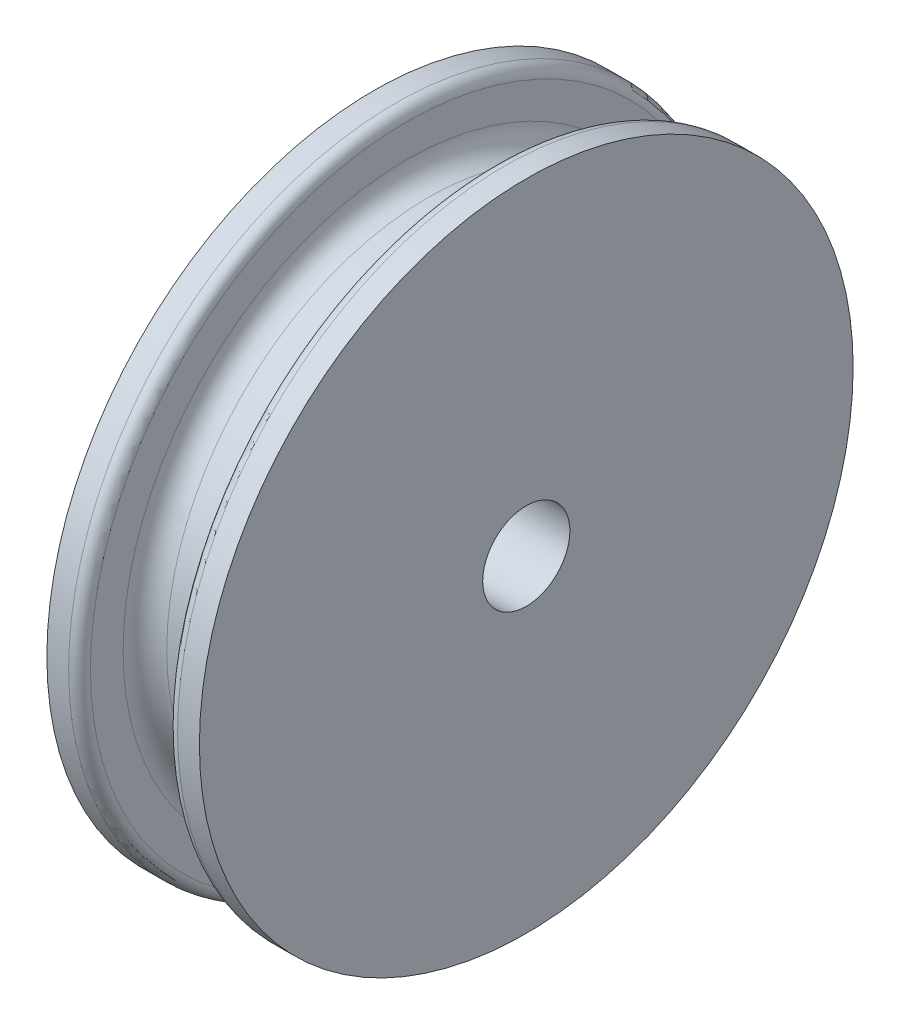
ISO-10303-21;
HEADER;
FILE_DESCRIPTION(('STEP AP214'),'2;1');
FILE_NAME('part.step','',(''),(''),'','','');
FILE_SCHEMA(('AUTOMOTIVE_DESIGN { 1 0 10303 214 1 1 1 1 }'));
ENDSEC;
DATA;
#1=APPLICATION_CONTEXT('core data for automotive mechanical design processes');
#2=APPLICATION_PROTOCOL_DEFINITION('international standard','automotive_design',2000,#1);
#3=PRODUCT_CONTEXT('',#1,'mechanical');
#4=PRODUCT('Part','Part','',(#3));
#5=PRODUCT_RELATED_PRODUCT_CATEGORY('part','',(#4));
#6=PRODUCT_DEFINITION_FORMATION('','',#4);
#7=PRODUCT_DEFINITION_CONTEXT('part definition',#1,'design');
#8=PRODUCT_DEFINITION('design','',#6,#7);
#9=PRODUCT_DEFINITION_SHAPE('','',#8);
#10=(LENGTH_UNIT() NAMED_UNIT(*) SI_UNIT(.MILLI.,.METRE.));
#11=(NAMED_UNIT(*) PLANE_ANGLE_UNIT() SI_UNIT($,.RADIAN.));
#12=(NAMED_UNIT(*) SI_UNIT($,.STERADIAN.) SOLID_ANGLE_UNIT());
#13=UNCERTAINTY_MEASURE_WITH_UNIT(LENGTH_MEASURE(1.E-05),#10,'distance_accuracy_value','');
#14=(GEOMETRIC_REPRESENTATION_CONTEXT(3) GLOBAL_UNCERTAINTY_ASSIGNED_CONTEXT((#13)) GLOBAL_UNIT_ASSIGNED_CONTEXT((#10,
#11,#12)) REPRESENTATION_CONTEXT('',''));
#15=CARTESIAN_POINT('',(0.,0.,0.));
#16=DIRECTION('',(0.,0.,1.));
#17=DIRECTION('',(1.,0.,0.));
#18=AXIS2_PLACEMENT_3D('',#15,#16,#17);
#19=CARTESIAN_POINT('',(1.75,1.,0.));
#20=DIRECTION('',(-1.,0.,0.));
#21=DIRECTION('',(0.,0.,1.));
#22=AXIS2_PLACEMENT_3D('',#19,#20,#21);
#23=PLANE('',#22);
#24=CARTESIAN_POINT('',(1.75,0.,0.));
#25=DIRECTION('',(-1.,0.,0.));
#26=DIRECTION('',(0.,0.,1.));
#27=AXIS2_PLACEMENT_3D('',#24,#25,#26);
#28=CIRCLE('',#27,7.5);
#29=CARTESIAN_POINT('',(1.75,0.,7.5));
#30=VERTEX_POINT('',#29);
#31=EDGE_CURVE('E71',#30,#30,#28,.T.);
#32=ORIENTED_EDGE('',*,*,#31,.F.);
#33=EDGE_LOOP('',(#32));
#34=FACE_BOUND('',#33,.T.);
#35=CARTESIAN_POINT('',(1.75,0.,0.));
#36=DIRECTION('',(-1.,0.,0.));
#37=DIRECTION('',(0.,0.,1.));
#38=AXIS2_PLACEMENT_3D('',#35,#36,#37);
#39=CIRCLE('',#38,1.);
#40=CARTESIAN_POINT('',(1.75,0.,1.));
#41=VERTEX_POINT('',#40);
#42=EDGE_CURVE('E50',#41,#41,#39,.T.);
#43=ORIENTED_EDGE('',*,*,#42,.T.);
#44=EDGE_LOOP('',(#43));
#45=FACE_BOUND('',#44,.T.);
#46=ADVANCED_FACE('F30',(#34,#45),#23,.F.);
#47=CARTESIAN_POINT('',(0.,0.,0.));
#48=DIRECTION('',(-1.,0.,0.));
#49=DIRECTION('',(0.,0.,1.));
#50=AXIS2_PLACEMENT_3D('',#47,#48,#49);
#51=CYLINDRICAL_SURFACE('',#50,1.);
#52=ORIENTED_EDGE('',*,*,#42,.F.);
#53=EDGE_LOOP('',(#52));
#54=FACE_BOUND('',#53,.T.);
#55=CARTESIAN_POINT('',(-1.75,0.,0.));
#56=DIRECTION('',(-1.,0.,0.));
#57=DIRECTION('',(0.,0.,1.));
#58=AXIS2_PLACEMENT_3D('',#55,#56,#57);
#59=CIRCLE('',#58,1.);
#60=CARTESIAN_POINT('',(-1.75,0.,1.));
#61=VERTEX_POINT('',#60);
#62=EDGE_CURVE('E53',#61,#61,#59,.T.);
#63=ORIENTED_EDGE('',*,*,#62,.T.);
#64=EDGE_LOOP('',(#63));
#65=FACE_BOUND('',#64,.T.);
#66=ADVANCED_FACE('F79',(#54,#65),#51,.F.);
#67=CARTESIAN_POINT('',(-1.75,1.,0.));
#68=DIRECTION('',(1.,0.,0.));
#69=DIRECTION('',(0.,0.,-1.));
#70=AXIS2_PLACEMENT_3D('',#67,#68,#69);
#71=PLANE('',#70);
#72=ORIENTED_EDGE('',*,*,#62,.F.);
#73=EDGE_LOOP('',(#72));
#74=FACE_BOUND('',#73,.T.);
#75=CARTESIAN_POINT('',(-1.75,0.,0.));
#76=DIRECTION('',(-1.,0.,0.));
#77=DIRECTION('',(0.,0.,1.));
#78=AXIS2_PLACEMENT_3D('',#75,#76,#77);
#79=CIRCLE('',#78,7.5);
#80=CARTESIAN_POINT('',(-1.75,0.,7.5));
#81=VERTEX_POINT('',#80);
#82=EDGE_CURVE('E56',#81,#81,#79,.T.);
#83=ORIENTED_EDGE('',*,*,#82,.T.);
#84=EDGE_LOOP('',(#83));
#85=FACE_BOUND('',#84,.T.);
#86=ADVANCED_FACE('F85',(#74,#85),#71,.F.);
#87=CARTESIAN_POINT('',(0.,0.,0.));
#88=DIRECTION('',(-1.,0.,0.));
#89=DIRECTION('',(0.,0.,1.));
#90=AXIS2_PLACEMENT_3D('',#87,#88,#89);
#91=CYLINDRICAL_SURFACE('',#90,7.5);
#92=CARTESIAN_POINT('',(-1.25,0.,0.));
#93=DIRECTION('',(-1.,0.,0.));
#94=DIRECTION('',(0.,0.,1.));
#95=AXIS2_PLACEMENT_3D('',#92,#93,#94);
#96=CIRCLE('',#95,7.5);
#97=CARTESIAN_POINT('',(-1.25,0.,7.5));
#98=VERTEX_POINT('',#97);
#99=EDGE_CURVE('E45',#98,#98,#96,.T.);
#100=ORIENTED_EDGE('',*,*,#99,.T.);
#101=EDGE_LOOP('',(#100));
#102=FACE_BOUND('',#101,.T.);
#103=ORIENTED_EDGE('',*,*,#82,.F.);
#104=EDGE_LOOP('',(#103));
#105=FACE_BOUND('',#104,.T.);
#106=ADVANCED_FACE('F91',(#102,#105),#91,.T.);
#107=CARTESIAN_POINT('',(-0.999999999999999,7.5,0.));
#108=DIRECTION('',(-1.,0.,0.));
#109=DIRECTION('',(0.,0.,1.));
#110=AXIS2_PLACEMENT_3D('',#107,#108,#109);
#111=PLANE('',#110);
#112=CARTESIAN_POINT('',(-0.999999999999999,0.,0.));
#113=DIRECTION('',(-1.,0.,0.));
#114=DIRECTION('',(0.,0.,1.));
#115=AXIS2_PLACEMENT_3D('',#112,#113,#114);
#116=CIRCLE('',#115,7.25);
#117=CARTESIAN_POINT('',(-0.999999999999999,0.,7.25));
#118=VERTEX_POINT('',#117);
#119=EDGE_CURVE('E41',#118,#118,#116,.F.);
#120=ORIENTED_EDGE('',*,*,#119,.T.);
#121=EDGE_LOOP('',(#120));
#122=FACE_BOUND('',#121,.T.);
#123=CARTESIAN_POINT('',(-0.999999999999999,0.,0.));
#124=DIRECTION('',(-1.,0.,0.));
#125=DIRECTION('',(0.,0.,1.));
#126=AXIS2_PLACEMENT_3D('',#123,#124,#125);
#127=CIRCLE('',#126,6.5);
#128=CARTESIAN_POINT('',(-0.999999999999999,0.,6.5));
#129=VERTEX_POINT('',#128);
#130=EDGE_CURVE('E59',#129,#129,#127,.T.);
#131=ORIENTED_EDGE('',*,*,#130,.T.);
#132=EDGE_LOOP('',(#131));
#133=FACE_BOUND('',#132,.T.);
#134=ADVANCED_FACE('F96',(#122,#133),#111,.F.);
#135=CARTESIAN_POINT('',(-0.499999999999999,0.,0.));
#136=DIRECTION('',(-1.,0.,0.));
#137=DIRECTION('',(0.,0.,1.));
#138=AXIS2_PLACEMENT_3D('',#135,#136,#137);
#139=TOROIDAL_SURFACE('',#138,6.5,0.5);
#140=ORIENTED_EDGE('',*,*,#130,.F.);
#141=EDGE_LOOP('',(#140));
#142=FACE_BOUND('',#141,.T.);
#143=CARTESIAN_POINT('',(-0.5,0.,0.));
#144=DIRECTION('',(-1.,0.,0.));
#145=DIRECTION('',(0.,0.,1.));
#146=AXIS2_PLACEMENT_3D('',#143,#144,#145);
#147=CIRCLE('',#146,6.);
#148=CARTESIAN_POINT('',(-0.5,0.,6.));
#149=VERTEX_POINT('',#148);
#150=EDGE_CURVE('E62',#149,#149,#147,.T.);
#151=ORIENTED_EDGE('',*,*,#150,.T.);
#152=EDGE_LOOP('',(#151));
#153=FACE_BOUND('',#152,.T.);
#154=ADVANCED_FACE('F102',(#142,#153),#139,.F.);
#155=CARTESIAN_POINT('',(0.,0.,0.));
#156=DIRECTION('',(-1.,0.,0.));
#157=DIRECTION('',(0.,0.,1.));
#158=AXIS2_PLACEMENT_3D('',#155,#156,#157);
#159=CYLINDRICAL_SURFACE('',#158,6.);
#160=ORIENTED_EDGE('',*,*,#150,.F.);
#161=EDGE_LOOP('',(#160));
#162=FACE_BOUND('',#161,.T.);
#163=CARTESIAN_POINT('',(0.499999999999999,0.,0.));
#164=DIRECTION('',(-1.,0.,0.));
#165=DIRECTION('',(0.,0.,1.));
#166=AXIS2_PLACEMENT_3D('',#163,#164,#165);
#167=CIRCLE('',#166,6.);
#168=CARTESIAN_POINT('',(0.499999999999999,0.,6.));
#169=VERTEX_POINT('',#168);
#170=EDGE_CURVE('E65',#169,#169,#167,.T.);
#171=ORIENTED_EDGE('',*,*,#170,.T.);
#172=EDGE_LOOP('',(#171));
#173=FACE_BOUND('',#172,.T.);
#174=ADVANCED_FACE('F124',(#162,#173),#159,.T.);
#175=CARTESIAN_POINT('',(0.499999999999999,0.,0.));
#176=DIRECTION('',(-1.,0.,0.));
#177=DIRECTION('',(0.,0.,1.));
#178=AXIS2_PLACEMENT_3D('',#175,#176,#177);
#179=TOROIDAL_SURFACE('',#178,6.5,0.5);
#180=ORIENTED_EDGE('',*,*,#170,.F.);
#181=EDGE_LOOP('',(#180));
#182=FACE_BOUND('',#181,.T.);
#183=CARTESIAN_POINT('',(1.,0.,0.));
#184=DIRECTION('',(-1.,0.,0.));
#185=DIRECTION('',(0.,0.,1.));
#186=AXIS2_PLACEMENT_3D('',#183,#184,#185);
#187=CIRCLE('',#186,6.5);
#188=CARTESIAN_POINT('',(1.,0.,6.5));
#189=VERTEX_POINT('',#188);
#190=EDGE_CURVE('E68',#189,#189,#187,.T.);
#191=ORIENTED_EDGE('',*,*,#190,.T.);
#192=EDGE_LOOP('',(#191));
#193=FACE_BOUND('',#192,.T.);
#194=ADVANCED_FACE('F129',(#182,#193),#179,.F.);
#195=CARTESIAN_POINT('',(0.999999999999999,7.5,0.));
#196=DIRECTION('',(1.,0.,0.));
#197=DIRECTION('',(0.,0.,-1.));
#198=AXIS2_PLACEMENT_3D('',#195,#196,#197);
#199=PLANE('',#198);
#200=CARTESIAN_POINT('',(0.999999999999999,0.,0.));
#201=DIRECTION('',(1.,0.,0.));
#202=DIRECTION('',(0.,0.,-1.));
#203=AXIS2_PLACEMENT_3D('',#200,#201,#202);
#204=CIRCLE('',#203,7.25);
#205=CARTESIAN_POINT('',(0.999999999999999,0.,-7.25));
#206=VERTEX_POINT('',#205);
#207=EDGE_CURVE('E37',#206,#206,#204,.F.);
#208=ORIENTED_EDGE('',*,*,#207,.T.);
#209=EDGE_LOOP('',(#208));
#210=FACE_BOUND('',#209,.T.);
#211=ORIENTED_EDGE('',*,*,#190,.F.);
#212=EDGE_LOOP('',(#211));
#213=FACE_BOUND('',#212,.T.);
#214=ADVANCED_FACE('F114',(#210,#213),#199,.F.);
#215=CARTESIAN_POINT('',(0.,0.,0.));
#216=DIRECTION('',(-1.,0.,0.));
#217=DIRECTION('',(0.,0.,1.));
#218=AXIS2_PLACEMENT_3D('',#215,#216,#217);
#219=CYLINDRICAL_SURFACE('',#218,7.5);
#220=CARTESIAN_POINT('',(1.25,0.,0.));
#221=DIRECTION('',(1.,0.,0.));
#222=DIRECTION('',(0.,0.,-1.));
#223=AXIS2_PLACEMENT_3D('',#220,#221,#222);
#224=CIRCLE('',#223,7.5);
#225=CARTESIAN_POINT('',(1.25,0.,-7.5));
#226=VERTEX_POINT('',#225);
#227=EDGE_CURVE('E10',#226,#226,#224,.T.);
#228=ORIENTED_EDGE('',*,*,#227,.T.);
#229=EDGE_LOOP('',(#228));
#230=FACE_BOUND('',#229,.T.);
#231=ORIENTED_EDGE('',*,*,#31,.T.);
#232=EDGE_LOOP('',(#231));
#233=FACE_BOUND('',#232,.T.);
#234=ADVANCED_FACE('F75',(#230,#233),#219,.T.);
#235=CARTESIAN_POINT('',(-1.25,0.,0.));
#236=DIRECTION('',(-1.,0.,0.));
#237=DIRECTION('',(0.,0.,1.));
#238=AXIS2_PLACEMENT_3D('',#235,#236,#237);
#239=TOROIDAL_SURFACE('',#238,7.25,0.25);
#240=ORIENTED_EDGE('',*,*,#119,.F.);
#241=EDGE_LOOP('',(#240));
#242=FACE_BOUND('',#241,.T.);
#243=ORIENTED_EDGE('',*,*,#99,.F.);
#244=EDGE_LOOP('',(#243));
#245=FACE_BOUND('',#244,.T.);
#246=ADVANCED_FACE('F106',(#242,#245),#239,.T.);
#247=CARTESIAN_POINT('',(1.25,0.,0.));
#248=DIRECTION('',(1.,0.,0.));
#249=DIRECTION('',(0.,0.,-1.));
#250=AXIS2_PLACEMENT_3D('',#247,#248,#249);
#251=TOROIDAL_SURFACE('',#250,7.25,0.25);
#252=ORIENTED_EDGE('',*,*,#227,.F.);
#253=EDGE_LOOP('',(#252));
#254=FACE_BOUND('',#253,.T.);
#255=ORIENTED_EDGE('',*,*,#207,.F.);
#256=EDGE_LOOP('',(#255));
#257=FACE_BOUND('',#256,.T.);
#258=ADVANCED_FACE('F32',(#254,#257),#251,.T.);
#259=CLOSED_SHELL('',(#46,#66,#86,#106,#134,#154,#174,#194,#214,#234,#246,#258));
#260=MANIFOLD_SOLID_BREP('B2',#259);
#261=ADVANCED_BREP_SHAPE_REPRESENTATION('',(#18,#260),#14);
#262=SHAPE_DEFINITION_REPRESENTATION(#9,#261);
ENDSEC;
END-ISO-10303-21;
